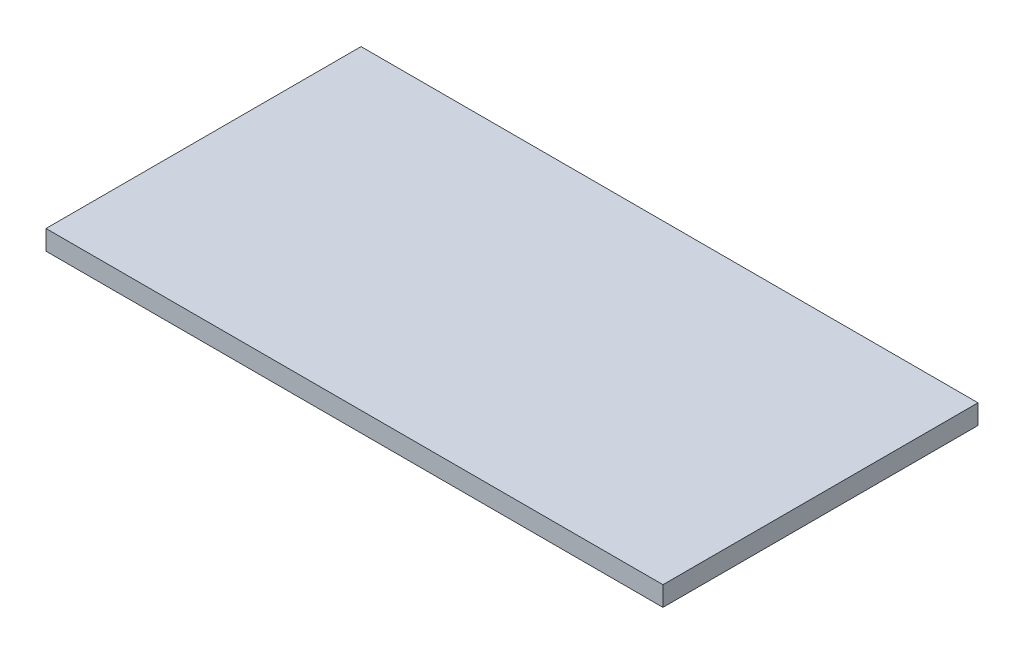
ISO-10303-21;
HEADER;
FILE_DESCRIPTION(('STEP AP214'),'2;1');
FILE_NAME('part.step','',(''),(''),'','','');
FILE_SCHEMA(('AUTOMOTIVE_DESIGN { 1 0 10303 214 1 1 1 1 }'));
ENDSEC;
DATA;
#1=APPLICATION_CONTEXT('core data for automotive mechanical design processes');
#2=APPLICATION_PROTOCOL_DEFINITION('international standard','automotive_design',2000,#1);
#3=PRODUCT_CONTEXT('',#1,'mechanical');
#4=PRODUCT('Part','Part','',(#3));
#5=PRODUCT_RELATED_PRODUCT_CATEGORY('part','',(#4));
#6=PRODUCT_DEFINITION_FORMATION('','',#4);
#7=PRODUCT_DEFINITION_CONTEXT('part definition',#1,'design');
#8=PRODUCT_DEFINITION('design','',#6,#7);
#9=PRODUCT_DEFINITION_SHAPE('','',#8);
#10=(LENGTH_UNIT() NAMED_UNIT(*) SI_UNIT(.MILLI.,.METRE.));
#11=(NAMED_UNIT(*) PLANE_ANGLE_UNIT() SI_UNIT($,.RADIAN.));
#12=(NAMED_UNIT(*) SI_UNIT($,.STERADIAN.) SOLID_ANGLE_UNIT());
#13=UNCERTAINTY_MEASURE_WITH_UNIT(LENGTH_MEASURE(1.E-05),#10,'distance_accuracy_value','');
#14=(GEOMETRIC_REPRESENTATION_CONTEXT(3) GLOBAL_UNCERTAINTY_ASSIGNED_CONTEXT((#13)) GLOBAL_UNIT_ASSIGNED_CONTEXT((#10,
#11,#12)) REPRESENTATION_CONTEXT('',''));
#15=CARTESIAN_POINT('',(0.,0.,0.));
#16=DIRECTION('',(0.,0.,1.));
#17=DIRECTION('',(1.,0.,0.));
#18=AXIS2_PLACEMENT_3D('',#15,#16,#17);
#19=CARTESIAN_POINT('',(-282.,18.,144.));
#20=DIRECTION('',(1.,0.,0.));
#21=DIRECTION('',(0.,0.,-1.));
#22=AXIS2_PLACEMENT_3D('',#19,#20,#21);
#23=PLANE('',#22);
#24=DIRECTION('',(0.,0.,1.));
#25=VECTOR('',#24,1.);
#26=CARTESIAN_POINT('',(-282.,0.,144.));
#27=LINE('',#26,#25);
#28=CARTESIAN_POINT('',(-282.,0.,-144.));
#29=VERTEX_POINT('',#28);
#30=CARTESIAN_POINT('',(-282.,0.,144.));
#31=VERTEX_POINT('',#30);
#32=EDGE_CURVE('E96',#29,#31,#27,.T.);
#33=ORIENTED_EDGE('',*,*,#32,.T.);
#34=DIRECTION('',(0.,-1.,0.));
#35=VECTOR('',#34,1.);
#36=CARTESIAN_POINT('',(-282.,18.,144.));
#37=LINE('',#36,#35);
#38=CARTESIAN_POINT('',(-282.,18.,144.));
#39=VERTEX_POINT('',#38);
#40=EDGE_CURVE('E11',#39,#31,#37,.T.);
#41=ORIENTED_EDGE('',*,*,#40,.F.);
#42=DIRECTION('',(0.,0.,1.));
#43=VECTOR('',#42,1.);
#44=CARTESIAN_POINT('',(-282.,18.,144.));
#45=LINE('',#44,#43);
#46=CARTESIAN_POINT('',(-282.,18.,-144.));
#47=VERTEX_POINT('',#46);
#48=EDGE_CURVE('E84',#47,#39,#45,.T.);
#49=ORIENTED_EDGE('',*,*,#48,.F.);
#50=DIRECTION('',(0.,-1.,0.));
#51=VECTOR('',#50,1.);
#52=CARTESIAN_POINT('',(-282.,18.,-144.));
#53=LINE('',#52,#51);
#54=EDGE_CURVE('E92',#47,#29,#53,.T.);
#55=ORIENTED_EDGE('',*,*,#54,.T.);
#56=EDGE_LOOP('',(#33,#41,#49,#55));
#57=FACE_BOUND('',#56,.T.);
#58=ADVANCED_FACE('F33',(#57),#23,.F.);
#59=CARTESIAN_POINT('',(282.,18.,144.));
#60=DIRECTION('',(0.,0.,-1.));
#61=DIRECTION('',(-1.,0.,0.));
#62=AXIS2_PLACEMENT_3D('',#59,#60,#61);
#63=PLANE('',#62);
#64=DIRECTION('',(1.,0.,0.));
#65=VECTOR('',#64,1.);
#66=CARTESIAN_POINT('',(282.,0.,144.));
#67=LINE('',#66,#65);
#68=CARTESIAN_POINT('',(282.,0.,144.));
#69=VERTEX_POINT('',#68);
#70=EDGE_CURVE('E88',#31,#69,#67,.T.);
#71=ORIENTED_EDGE('',*,*,#70,.T.);
#72=DIRECTION('',(0.,-1.,0.));
#73=VECTOR('',#72,1.);
#74=CARTESIAN_POINT('',(282.,18.,144.));
#75=LINE('',#74,#73);
#76=CARTESIAN_POINT('',(282.,18.,144.));
#77=VERTEX_POINT('',#76);
#78=EDGE_CURVE('E41',#77,#69,#75,.T.);
#79=ORIENTED_EDGE('',*,*,#78,.F.);
#80=DIRECTION('',(1.,0.,0.));
#81=VECTOR('',#80,1.);
#82=CARTESIAN_POINT('',(282.,18.,144.));
#83=LINE('',#82,#81);
#84=EDGE_CURVE('E79',#39,#77,#83,.T.);
#85=ORIENTED_EDGE('',*,*,#84,.F.);
#86=ORIENTED_EDGE('',*,*,#40,.T.);
#87=EDGE_LOOP('',(#71,#79,#85,#86));
#88=FACE_BOUND('',#87,.T.);
#89=ADVANCED_FACE('F87',(#88),#63,.F.);
#90=CARTESIAN_POINT('',(282.,18.,144.));
#91=DIRECTION('',(-1.,0.,0.));
#92=DIRECTION('',(0.,0.,1.));
#93=AXIS2_PLACEMENT_3D('',#90,#91,#92);
#94=PLANE('',#93);
#95=DIRECTION('',(0.,0.,-1.));
#96=VECTOR('',#95,1.);
#97=CARTESIAN_POINT('',(282.,0.,144.));
#98=LINE('',#97,#96);
#99=CARTESIAN_POINT('',(282.,0.,-144.));
#100=VERTEX_POINT('',#99);
#101=EDGE_CURVE('E66',#69,#100,#98,.T.);
#102=ORIENTED_EDGE('',*,*,#101,.T.);
#103=DIRECTION('',(0.,-1.,0.));
#104=VECTOR('',#103,1.);
#105=CARTESIAN_POINT('',(282.,18.,-144.));
#106=LINE('',#105,#104);
#107=CARTESIAN_POINT('',(282.,18.,-144.));
#108=VERTEX_POINT('',#107);
#109=EDGE_CURVE('E89',#108,#100,#106,.T.);
#110=ORIENTED_EDGE('',*,*,#109,.F.);
#111=DIRECTION('',(0.,0.,-1.));
#112=VECTOR('',#111,1.);
#113=CARTESIAN_POINT('',(282.,18.,144.));
#114=LINE('',#113,#112);
#115=EDGE_CURVE('E82',#77,#108,#114,.T.);
#116=ORIENTED_EDGE('',*,*,#115,.F.);
#117=ORIENTED_EDGE('',*,*,#78,.T.);
#118=EDGE_LOOP('',(#102,#110,#116,#117));
#119=FACE_BOUND('',#118,.T.);
#120=ADVANCED_FACE('F90',(#119),#94,.F.);
#121=CARTESIAN_POINT('',(282.,18.,-144.));
#122=DIRECTION('',(0.,0.,1.));
#123=DIRECTION('',(1.,0.,0.));
#124=AXIS2_PLACEMENT_3D('',#121,#122,#123);
#125=PLANE('',#124);
#126=DIRECTION('',(-1.,0.,0.));
#127=VECTOR('',#126,1.);
#128=CARTESIAN_POINT('',(282.,0.,-144.));
#129=LINE('',#128,#127);
#130=EDGE_CURVE('E72',#100,#29,#129,.T.);
#131=ORIENTED_EDGE('',*,*,#130,.T.);
#132=ORIENTED_EDGE('',*,*,#54,.F.);
#133=DIRECTION('',(-1.,0.,0.));
#134=VECTOR('',#133,1.);
#135=CARTESIAN_POINT('',(282.,18.,-144.));
#136=LINE('',#135,#134);
#137=EDGE_CURVE('E49',#108,#47,#136,.T.);
#138=ORIENTED_EDGE('',*,*,#137,.F.);
#139=ORIENTED_EDGE('',*,*,#109,.T.);
#140=EDGE_LOOP('',(#131,#132,#138,#139));
#141=FACE_BOUND('',#140,.T.);
#142=ADVANCED_FACE('F103',(#141),#125,.F.);
#143=CARTESIAN_POINT('',(0.,18.,0.));
#144=DIRECTION('',(0.,1.,0.));
#145=DIRECTION('',(0.,0.,1.));
#146=AXIS2_PLACEMENT_3D('',#143,#144,#145);
#147=PLANE('',#146);
#148=ORIENTED_EDGE('',*,*,#48,.T.);
#149=ORIENTED_EDGE('',*,*,#84,.T.);
#150=ORIENTED_EDGE('',*,*,#115,.T.);
#151=ORIENTED_EDGE('',*,*,#137,.T.);
#152=EDGE_LOOP('',(#148,#149,#150,#151));
#153=FACE_BOUND('',#152,.T.);
#154=ADVANCED_FACE('F80',(#153),#147,.T.);
#155=CARTESIAN_POINT('',(0.,0.,0.));
#156=DIRECTION('',(0.,1.,0.));
#157=DIRECTION('',(0.,0.,1.));
#158=AXIS2_PLACEMENT_3D('',#155,#156,#157);
#159=PLANE('',#158);
#160=ORIENTED_EDGE('',*,*,#32,.F.);
#161=ORIENTED_EDGE('',*,*,#130,.F.);
#162=ORIENTED_EDGE('',*,*,#101,.F.);
#163=ORIENTED_EDGE('',*,*,#70,.F.);
#164=EDGE_LOOP('',(#160,#161,#162,#163));
#165=FACE_BOUND('',#164,.T.);
#166=ADVANCED_FACE('F106',(#165),#159,.F.);
#167=CLOSED_SHELL('',(#58,#89,#120,#142,#154,#166));
#168=MANIFOLD_SOLID_BREP('B2',#167);
#169=ADVANCED_BREP_SHAPE_REPRESENTATION('',(#18,#168),#14);
#170=SHAPE_DEFINITION_REPRESENTATION(#9,#169);
ENDSEC;
END-ISO-10303-21;
